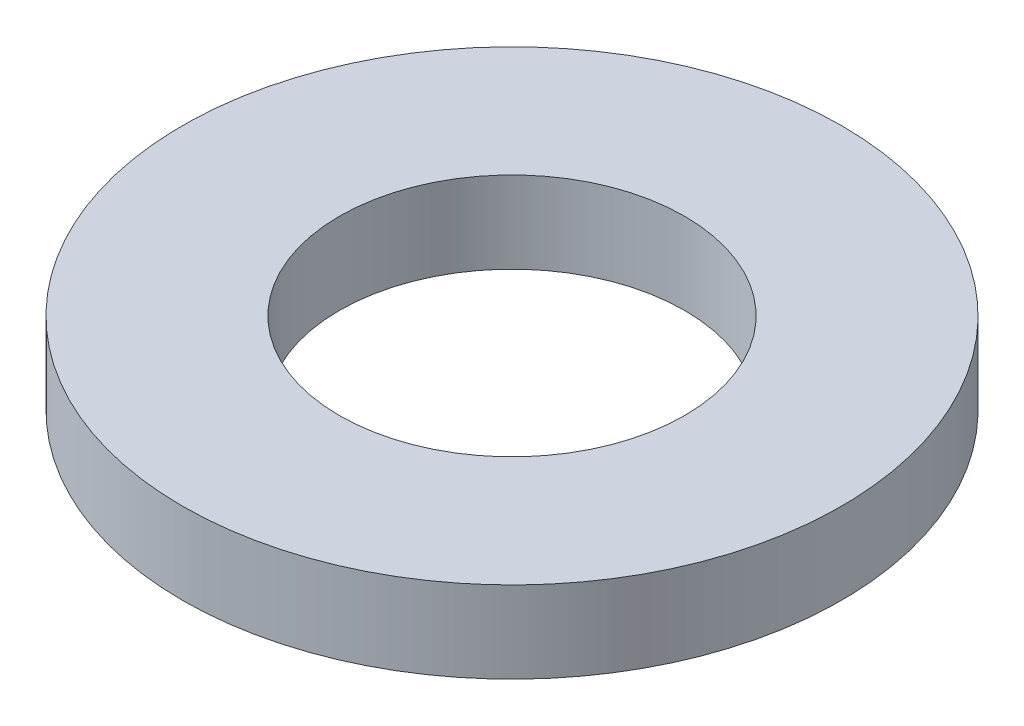
ISO-10303-21;
HEADER;
FILE_DESCRIPTION(('STEP AP214'),'2;1');
FILE_NAME('part.step','',(''),(''),'','','');
FILE_SCHEMA(('AUTOMOTIVE_DESIGN { 1 0 10303 214 1 1 1 1 }'));
ENDSEC;
DATA;
#1=APPLICATION_CONTEXT('core data for automotive mechanical design processes');
#2=APPLICATION_PROTOCOL_DEFINITION('international standard','automotive_design',2000,#1);
#3=PRODUCT_CONTEXT('',#1,'mechanical');
#4=PRODUCT('Part','Part','',(#3));
#5=PRODUCT_RELATED_PRODUCT_CATEGORY('part','',(#4));
#6=PRODUCT_DEFINITION_FORMATION('','',#4);
#7=PRODUCT_DEFINITION_CONTEXT('part definition',#1,'design');
#8=PRODUCT_DEFINITION('design','',#6,#7);
#9=PRODUCT_DEFINITION_SHAPE('','',#8);
#10=(LENGTH_UNIT() NAMED_UNIT(*) SI_UNIT(.MILLI.,.METRE.));
#11=(NAMED_UNIT(*) PLANE_ANGLE_UNIT() SI_UNIT($,.RADIAN.));
#12=(NAMED_UNIT(*) SI_UNIT($,.STERADIAN.) SOLID_ANGLE_UNIT());
#13=UNCERTAINTY_MEASURE_WITH_UNIT(LENGTH_MEASURE(1.E-05),#10,'distance_accuracy_value','');
#14=(GEOMETRIC_REPRESENTATION_CONTEXT(3) GLOBAL_UNCERTAINTY_ASSIGNED_CONTEXT((#13)) GLOBAL_UNIT_ASSIGNED_CONTEXT((#10,
#11,#12)) REPRESENTATION_CONTEXT('',''));
#15=CARTESIAN_POINT('',(0.,0.,0.));
#16=DIRECTION('',(0.,0.,1.));
#17=DIRECTION('',(1.,0.,0.));
#18=AXIS2_PLACEMENT_3D('',#15,#16,#17);
#19=CARTESIAN_POINT('',(0.,13.,0.));
#20=DIRECTION('',(0.,-1.,0.));
#21=DIRECTION('',(0.,0.,-1.));
#22=AXIS2_PLACEMENT_3D('',#19,#20,#21);
#23=CYLINDRICAL_SURFACE('',#22,52.5);
#24=CARTESIAN_POINT('',(0.,13.,0.));
#25=DIRECTION('',(0.,1.,0.));
#26=DIRECTION('',(0.,0.,1.));
#27=AXIS2_PLACEMENT_3D('',#24,#25,#26);
#28=CIRCLE('',#27,52.5);
#29=CARTESIAN_POINT('',(0.,13.,-52.5));
#30=VERTEX_POINT('',#29);
#31=EDGE_CURVE('E10',#30,#30,#28,.T.);
#32=CARTESIAN_POINT('',(0.,0.,0.));
#33=DIRECTION('',(0.,1.,0.));
#34=DIRECTION('',(0.,0.,1.));
#35=AXIS2_PLACEMENT_3D('',#32,#33,#34);
#36=CIRCLE('',#35,52.5);
#37=CARTESIAN_POINT('',(0.,0.,-52.5));
#38=VERTEX_POINT('',#37);
#39=EDGE_CURVE('E37',#38,#38,#36,.T.);
#40=CARTESIAN_POINT('',(0.,13.,-52.5));
#41=CARTESIAN_POINT('',(0.,12.8645833333333,-52.5));
#42=CARTESIAN_POINT('',(0.,12.7291666666667,-52.5));
#43=CARTESIAN_POINT('',(0.,12.4583333333333,-52.5));
#44=CARTESIAN_POINT('',(0.,12.3229166666667,-52.5));
#45=CARTESIAN_POINT('',(0.,12.0520833333333,-52.5));
#46=CARTESIAN_POINT('',(0.,11.9166666666667,-52.5));
#47=CARTESIAN_POINT('',(0.,11.6458333333333,-52.5));
#48=CARTESIAN_POINT('',(0.,11.5104166666667,-52.5));
#49=CARTESIAN_POINT('',(0.,11.2395833333333,-52.5));
#50=CARTESIAN_POINT('',(0.,11.1041666666667,-52.5));
#51=CARTESIAN_POINT('',(0.,10.8333333333333,-52.5));
#52=CARTESIAN_POINT('',(0.,10.6979166666667,-52.5));
#53=CARTESIAN_POINT('',(0.,10.4270833333333,-52.5));
#54=CARTESIAN_POINT('',(0.,10.2916666666667,-52.5));
#55=CARTESIAN_POINT('',(0.,10.0208333333333,-52.5));
#56=CARTESIAN_POINT('',(0.,9.88541666666667,-52.5));
#57=CARTESIAN_POINT('',(0.,9.61458333333333,-52.5));
#58=CARTESIAN_POINT('',(0.,9.47916666666667,-52.5));
#59=CARTESIAN_POINT('',(0.,9.20833333333333,-52.5));
#60=CARTESIAN_POINT('',(0.,9.07291666666667,-52.5));
#61=CARTESIAN_POINT('',(0.,8.80208333333333,-52.5));
#62=CARTESIAN_POINT('',(0.,8.66666666666667,-52.5));
#63=CARTESIAN_POINT('',(0.,8.39583333333333,-52.5));
#64=CARTESIAN_POINT('',(0.,8.26041666666667,-52.5));
#65=CARTESIAN_POINT('',(0.,7.98958333333333,-52.5));
#66=CARTESIAN_POINT('',(0.,7.85416666666667,-52.5));
#67=CARTESIAN_POINT('',(0.,7.58333333333333,-52.5));
#68=CARTESIAN_POINT('',(0.,7.44791666666667,-52.5));
#69=CARTESIAN_POINT('',(0.,7.17708333333333,-52.5));
#70=CARTESIAN_POINT('',(0.,7.04166666666667,-52.5));
#71=CARTESIAN_POINT('',(0.,6.77083333333333,-52.5));
#72=CARTESIAN_POINT('',(0.,6.63541666666667,-52.5));
#73=CARTESIAN_POINT('',(0.,6.36458333333333,-52.5));
#74=CARTESIAN_POINT('',(0.,6.22916666666667,-52.5));
#75=CARTESIAN_POINT('',(0.,5.95833333333333,-52.5));
#76=CARTESIAN_POINT('',(0.,5.82291666666667,-52.5));
#77=CARTESIAN_POINT('',(0.,5.55208333333333,-52.5));
#78=CARTESIAN_POINT('',(0.,5.41666666666667,-52.5));
#79=CARTESIAN_POINT('',(0.,5.14583333333333,-52.5));
#80=CARTESIAN_POINT('',(0.,5.01041666666667,-52.5));
#81=CARTESIAN_POINT('',(0.,4.73958333333333,-52.5));
#82=CARTESIAN_POINT('',(0.,4.60416666666667,-52.5));
#83=CARTESIAN_POINT('',(0.,4.33333333333333,-52.5));
#84=CARTESIAN_POINT('',(0.,4.19791666666667,-52.5));
#85=CARTESIAN_POINT('',(0.,3.92708333333333,-52.5));
#86=CARTESIAN_POINT('',(0.,3.79166666666667,-52.5));
#87=CARTESIAN_POINT('',(0.,3.52083333333333,-52.5));
#88=CARTESIAN_POINT('',(0.,3.38541666666667,-52.5));
#89=CARTESIAN_POINT('',(0.,3.11458333333333,-52.5));
#90=CARTESIAN_POINT('',(0.,2.97916666666667,-52.5));
#91=CARTESIAN_POINT('',(0.,2.70833333333333,-52.5));
#92=CARTESIAN_POINT('',(0.,2.57291666666667,-52.5));
#93=CARTESIAN_POINT('',(0.,2.30208333333333,-52.5));
#94=CARTESIAN_POINT('',(0.,2.16666666666667,-52.5));
#95=CARTESIAN_POINT('',(0.,1.89583333333333,-52.5));
#96=CARTESIAN_POINT('',(0.,1.76041666666667,-52.5));
#97=CARTESIAN_POINT('',(0.,1.48958333333333,-52.5));
#98=CARTESIAN_POINT('',(0.,1.35416666666667,-52.5));
#99=CARTESIAN_POINT('',(0.,1.08333333333333,-52.5));
#100=CARTESIAN_POINT('',(0.,0.947916666666667,-52.5));
#101=CARTESIAN_POINT('',(0.,0.677083333333334,-52.5));
#102=CARTESIAN_POINT('',(0.,0.541666666666667,-52.5));
#103=CARTESIAN_POINT('',(0.,0.270833333333334,-52.5));
#104=CARTESIAN_POINT('',(0.,0.135416666666667,-52.5));
#105=CARTESIAN_POINT('',(0.,0.,-52.5));
#106=B_SPLINE_CURVE_WITH_KNOTS('',3,(#40,#41,#42,#43,#44,#45,#46,#47,#48,#49,#50,#51,#52,#53,
#54,#55,#56,#57,#58,#59,#60,#61,#62,#63,#64,#65,#66,#67,#68,#69,#70,#71,#72,#73,#74,#75,#76,#77,
#78,#79,#80,#81,#82,#83,#84,#85,#86,#87,#88,#89,#90,#91,#92,#93,#94,#95,#96,#97,#98,#99,#100,
#101,#102,#103,#104,#105),.UNSPECIFIED.,.F.,.F.,(4,2,2,2,2,2,2,2,2,2,2,2,2,2,2,2,2,2,2,2,2,2,2,
2,2,2,2,2,2,2,2,2,4),(0.,0.406249999999999,0.812499999999999,1.21875,1.625,2.03125,2.4375,
2.84375,3.25,3.65625,4.0625,4.46875,4.875,5.28125,5.6875,6.09375,6.5,6.90625,7.3125,7.71875,
8.125,8.53125,8.9375,9.34375,9.75,10.15625,10.5625,10.96875,11.375,11.78125,12.1875,12.59375,
13.),.UNSPECIFIED.);
#107=EDGE_CURVE('BSEAM40',#30,#38,#106,.T.);
#108=ORIENTED_EDGE('',*,*,#31,.F.);
#109=ORIENTED_EDGE('',*,*,#39,.T.);
#110=ORIENTED_EDGE('',*,*,#107,.T.);
#111=ORIENTED_EDGE('',*,*,#107,.F.);
#112=EDGE_LOOP('',(#108,#110,#109,#111));
#113=FACE_BOUND('',#112,.T.);
#114=ADVANCED_FACE('F40',(#113),#23,.T.);
#115=CARTESIAN_POINT('',(0.,13.,0.));
#116=DIRECTION('',(0.,1.,0.));
#117=DIRECTION('',(0.,0.,1.));
#118=AXIS2_PLACEMENT_3D('',#115,#116,#117);
#119=PLANE('',#118);
#120=CARTESIAN_POINT('',(0.,13.,0.));
#121=DIRECTION('',(0.,1.,0.));
#122=DIRECTION('',(0.,0.,1.));
#123=AXIS2_PLACEMENT_3D('',#120,#121,#122);
#124=CIRCLE('',#123,27.5);
#125=CARTESIAN_POINT('',(0.,13.,-27.5));
#126=VERTEX_POINT('',#125);
#127=EDGE_CURVE('E50',#126,#126,#124,.T.);
#128=ORIENTED_EDGE('',*,*,#127,.F.);
#129=EDGE_LOOP('',(#128));
#130=FACE_BOUND('',#129,.T.);
#131=ORIENTED_EDGE('',*,*,#31,.T.);
#132=EDGE_LOOP('',(#131));
#133=FACE_BOUND('',#132,.T.);
#134=ADVANCED_FACE('F59',(#130,#133),#119,.T.);
#135=CARTESIAN_POINT('',(0.,0.,0.));
#136=DIRECTION('',(0.,1.,0.));
#137=DIRECTION('',(0.,0.,1.));
#138=AXIS2_PLACEMENT_3D('',#135,#136,#137);
#139=PLANE('',#138);
#140=CARTESIAN_POINT('',(0.,0.,0.));
#141=DIRECTION('',(0.,1.,0.));
#142=DIRECTION('',(0.,0.,1.));
#143=AXIS2_PLACEMENT_3D('',#140,#141,#142);
#144=CIRCLE('',#143,27.5);
#145=CARTESIAN_POINT('',(0.,0.,-27.5));
#146=VERTEX_POINT('',#145);
#147=EDGE_CURVE('E47',#146,#146,#144,.T.);
#148=ORIENTED_EDGE('',*,*,#147,.T.);
#149=EDGE_LOOP('',(#148));
#150=FACE_BOUND('',#149,.T.);
#151=ORIENTED_EDGE('',*,*,#39,.F.);
#152=EDGE_LOOP('',(#151));
#153=FACE_BOUND('',#152,.T.);
#154=ADVANCED_FACE('F58',(#150,#153),#139,.F.);
#155=CARTESIAN_POINT('',(0.,13.,0.));
#156=DIRECTION('',(0.,-1.,0.));
#157=DIRECTION('',(0.,0.,-1.));
#158=AXIS2_PLACEMENT_3D('',#155,#156,#157);
#159=CYLINDRICAL_SURFACE('',#158,27.5);
#160=CARTESIAN_POINT('',(0.,13.,-27.5));
#161=CARTESIAN_POINT('',(0.,12.8645833333333,-27.5));
#162=CARTESIAN_POINT('',(0.,12.7291666666667,-27.5));
#163=CARTESIAN_POINT('',(0.,12.4583333333333,-27.5));
#164=CARTESIAN_POINT('',(0.,12.3229166666667,-27.5));
#165=CARTESIAN_POINT('',(0.,12.0520833333333,-27.5));
#166=CARTESIAN_POINT('',(0.,11.9166666666667,-27.5));
#167=CARTESIAN_POINT('',(0.,11.6458333333333,-27.5));
#168=CARTESIAN_POINT('',(0.,11.5104166666667,-27.5));
#169=CARTESIAN_POINT('',(0.,11.2395833333333,-27.5));
#170=CARTESIAN_POINT('',(0.,11.1041666666667,-27.5));
#171=CARTESIAN_POINT('',(0.,10.8333333333333,-27.5));
#172=CARTESIAN_POINT('',(0.,10.6979166666667,-27.5));
#173=CARTESIAN_POINT('',(0.,10.4270833333333,-27.5));
#174=CARTESIAN_POINT('',(0.,10.2916666666667,-27.5));
#175=CARTESIAN_POINT('',(0.,10.0208333333333,-27.5));
#176=CARTESIAN_POINT('',(0.,9.88541666666667,-27.5));
#177=CARTESIAN_POINT('',(0.,9.61458333333333,-27.5));
#178=CARTESIAN_POINT('',(0.,9.47916666666667,-27.5));
#179=CARTESIAN_POINT('',(0.,9.20833333333333,-27.5));
#180=CARTESIAN_POINT('',(0.,9.07291666666666,-27.5));
#181=CARTESIAN_POINT('',(0.,8.80208333333333,-27.5));
#182=CARTESIAN_POINT('',(0.,8.66666666666667,-27.5));
#183=CARTESIAN_POINT('',(0.,8.39583333333333,-27.5));
#184=CARTESIAN_POINT('',(0.,8.26041666666667,-27.5));
#185=CARTESIAN_POINT('',(0.,7.98958333333333,-27.5));
#186=CARTESIAN_POINT('',(0.,7.85416666666667,-27.5));
#187=CARTESIAN_POINT('',(0.,7.58333333333333,-27.5));
#188=CARTESIAN_POINT('',(0.,7.44791666666667,-27.5));
#189=CARTESIAN_POINT('',(0.,7.17708333333333,-27.5));
#190=CARTESIAN_POINT('',(0.,7.04166666666667,-27.5));
#191=CARTESIAN_POINT('',(0.,6.77083333333333,-27.5));
#192=CARTESIAN_POINT('',(0.,6.63541666666667,-27.5));
#193=CARTESIAN_POINT('',(0.,6.36458333333333,-27.5));
#194=CARTESIAN_POINT('',(0.,6.22916666666667,-27.5));
#195=CARTESIAN_POINT('',(0.,5.95833333333333,-27.5));
#196=CARTESIAN_POINT('',(0.,5.82291666666667,-27.5));
#197=CARTESIAN_POINT('',(0.,5.55208333333333,-27.5));
#198=CARTESIAN_POINT('',(0.,5.41666666666667,-27.5));
#199=CARTESIAN_POINT('',(0.,5.14583333333333,-27.5));
#200=CARTESIAN_POINT('',(0.,5.01041666666667,-27.5));
#201=CARTESIAN_POINT('',(0.,4.73958333333333,-27.5));
#202=CARTESIAN_POINT('',(0.,4.60416666666667,-27.5));
#203=CARTESIAN_POINT('',(0.,4.33333333333333,-27.5));
#204=CARTESIAN_POINT('',(0.,4.19791666666667,-27.5));
#205=CARTESIAN_POINT('',(0.,3.92708333333333,-27.5));
#206=CARTESIAN_POINT('',(0.,3.79166666666667,-27.5));
#207=CARTESIAN_POINT('',(0.,3.52083333333333,-27.5));
#208=CARTESIAN_POINT('',(0.,3.38541666666667,-27.5));
#209=CARTESIAN_POINT('',(0.,3.11458333333333,-27.5));
#210=CARTESIAN_POINT('',(0.,2.97916666666667,-27.5));
#211=CARTESIAN_POINT('',(0.,2.70833333333333,-27.5));
#212=CARTESIAN_POINT('',(0.,2.57291666666667,-27.5));
#213=CARTESIAN_POINT('',(0.,2.30208333333333,-27.5));
#214=CARTESIAN_POINT('',(0.,2.16666666666667,-27.5));
#215=CARTESIAN_POINT('',(0.,1.89583333333333,-27.5));
#216=CARTESIAN_POINT('',(0.,1.76041666666667,-27.5));
#217=CARTESIAN_POINT('',(0.,1.48958333333333,-27.5));
#218=CARTESIAN_POINT('',(0.,1.35416666666667,-27.5));
#219=CARTESIAN_POINT('',(0.,1.08333333333333,-27.5));
#220=CARTESIAN_POINT('',(0.,0.947916666666667,-27.5));
#221=CARTESIAN_POINT('',(0.,0.677083333333334,-27.5));
#222=CARTESIAN_POINT('',(0.,0.541666666666667,-27.5));
#223=CARTESIAN_POINT('',(0.,0.270833333333334,-27.5));
#224=CARTESIAN_POINT('',(0.,0.135416666666667,-27.5));
#225=CARTESIAN_POINT('',(0.,0.,-27.5));
#226=B_SPLINE_CURVE_WITH_KNOTS('',3,(#160,#161,#162,#163,#164,#165,#166,#167,#168,#169,#170,
#171,#172,#173,#174,#175,#176,#177,#178,#179,#180,#181,#182,#183,#184,#185,#186,#187,#188,#189,
#190,#191,#192,#193,#194,#195,#196,#197,#198,#199,#200,#201,#202,#203,#204,#205,#206,#207,#208,
#209,#210,#211,#212,#213,#214,#215,#216,#217,#218,#219,#220,#221,#222,#223,#224,#225),
.UNSPECIFIED.,.F.,.F.,(4,2,2,2,2,2,2,2,2,2,2,2,2,2,2,2,2,2,2,2,2,2,2,2,2,2,2,2,2,2,2,2,4),(0.,
0.40625,0.812500000000001,1.21875,1.625,2.03125,2.4375,2.84375,3.25,3.65625,4.0625,4.46875,
4.875,5.28125,5.6875,6.09375,6.5,6.90625,7.3125,7.71875,8.125,8.53125,8.9375,9.34375,9.75,
10.15625,10.5625,10.96875,11.375,11.78125,12.1875,12.59375,13.),.UNSPECIFIED.);
#227=EDGE_CURVE('BSEAM54',#126,#146,#226,.T.);
#228=ORIENTED_EDGE('',*,*,#127,.T.);
#229=ORIENTED_EDGE('',*,*,#147,.F.);
#230=ORIENTED_EDGE('',*,*,#227,.T.);
#231=ORIENTED_EDGE('',*,*,#227,.F.);
#232=EDGE_LOOP('',(#228,#230,#229,#231));
#233=FACE_BOUND('',#232,.T.);
#234=ADVANCED_FACE('F54',(#233),#159,.F.);
#235=CLOSED_SHELL('',(#114,#134,#154,#234));
#236=MANIFOLD_SOLID_BREP('B2',#235);
#237=ADVANCED_BREP_SHAPE_REPRESENTATION('',(#18,#236),#14);
#238=SHAPE_DEFINITION_REPRESENTATION(#9,#237);
ENDSEC;
END-ISO-10303-21;
